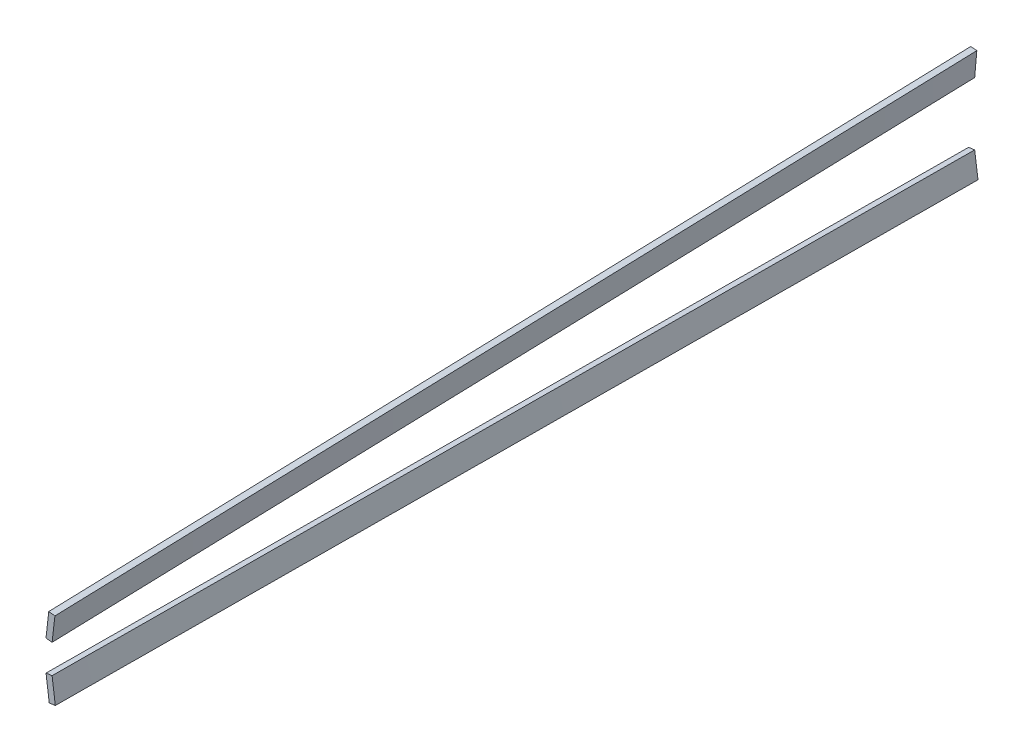
ISO-10303-21;
HEADER;
FILE_DESCRIPTION(('STEP AP214'),'2;1');
FILE_NAME('part.step','',(''),(''),'','','');
FILE_SCHEMA(('AUTOMOTIVE_DESIGN { 1 0 10303 214 1 1 1 1 }'));
ENDSEC;
DATA;
#1=APPLICATION_CONTEXT('core data for automotive mechanical design processes');
#2=APPLICATION_PROTOCOL_DEFINITION('international standard','automotive_design',2000,#1);
#3=PRODUCT_CONTEXT('',#1,'mechanical');
#4=PRODUCT('Part','Part','',(#3));
#5=PRODUCT_RELATED_PRODUCT_CATEGORY('part','',(#4));
#6=PRODUCT_DEFINITION_FORMATION('','',#4);
#7=PRODUCT_DEFINITION_CONTEXT('part definition',#1,'design');
#8=PRODUCT_DEFINITION('design','',#6,#7);
#9=PRODUCT_DEFINITION_SHAPE('','',#8);
#10=(LENGTH_UNIT() NAMED_UNIT(*) SI_UNIT(.MILLI.,.METRE.));
#11=(NAMED_UNIT(*) PLANE_ANGLE_UNIT() SI_UNIT($,.RADIAN.));
#12=(NAMED_UNIT(*) SI_UNIT($,.STERADIAN.) SOLID_ANGLE_UNIT());
#13=UNCERTAINTY_MEASURE_WITH_UNIT(LENGTH_MEASURE(1.E-05),#10,'distance_accuracy_value','');
#14=(GEOMETRIC_REPRESENTATION_CONTEXT(3) GLOBAL_UNCERTAINTY_ASSIGNED_CONTEXT((#13)) GLOBAL_UNIT_ASSIGNED_CONTEXT((#10,
#11,#12)) REPRESENTATION_CONTEXT('',''));
#15=CARTESIAN_POINT('',(0.,0.,0.));
#16=DIRECTION('',(0.,0.,1.));
#17=DIRECTION('',(1.,0.,0.));
#18=AXIS2_PLACEMENT_3D('',#15,#16,#17);
#19=CARTESIAN_POINT('',(0.,0.,478.663));
#20=DIRECTION('',(0.,0.,1.));
#21=DIRECTION('',(-1.,0.,0.));
#22=AXIS2_PLACEMENT_3D('',#19,#20,#21);
#23=PLANE('',#22);
#24=CARTESIAN_POINT('',(293.325645427331,15.0769843062237,478.663));
#25=CARTESIAN_POINT('',(293.850159198654,15.1470033379491,478.663));
#26=CARTESIAN_POINT('',(294.374672969977,15.2170223696745,478.663));
#27=CARTESIAN_POINT('',(295.423700512623,15.3570604331252,478.663));
#28=CARTESIAN_POINT('',(295.948214283946,15.4270794648505,478.663));
#29=CARTESIAN_POINT('',(296.472728055268,15.4970984965758,478.663));
#30=B_SPLINE_CURVE_WITH_KNOTS('',3,(#24,#25,#26,#27,#28,#29),.UNSPECIFIED.,.F.,.F.,(4,2,4),(0.,
0.5,1.),.UNSPECIFIED.);
#31=CARTESIAN_POINT('',(293.325645427331,15.0769843062237,478.663));
#32=VERTEX_POINT('',#31);
#33=CARTESIAN_POINT('',(296.472728055268,15.4970984965758,478.663));
#34=VERTEX_POINT('',#33);
#35=EDGE_CURVE('E169',#32,#34,#30,.T.);
#36=ORIENTED_EDGE('',*,*,#35,.F.);
#37=CARTESIAN_POINT('',(295.006102188739,2.48865379447442,478.663));
#38=CARTESIAN_POINT('',(294.726026061838,4.58670887976591,478.663));
#39=CARTESIAN_POINT('',(294.445949934936,6.68476396505743,478.663));
#40=CARTESIAN_POINT('',(293.885797681134,10.8808741356405,478.663));
#41=CARTESIAN_POINT('',(293.605721554232,12.9789292209321,478.663));
#42=CARTESIAN_POINT('',(293.325645427331,15.0769843062237,478.663));
#43=B_SPLINE_CURVE_WITH_KNOTS('',3,(#37,#38,#39,#40,#41,#42),.UNSPECIFIED.,.F.,.F.,(4,2,4),(0.,
0.5,1.),.UNSPECIFIED.);
#44=CARTESIAN_POINT('',(295.006102188739,2.48865379447443,478.663));
#45=VERTEX_POINT('',#44);
#46=EDGE_CURVE('E13',#45,#32,#43,.T.);
#47=ORIENTED_EDGE('',*,*,#46,.F.);
#48=CARTESIAN_POINT('',(298.149010464063,2.90772029071021,478.663000000001));
#49=CARTESIAN_POINT('',(297.738036460832,2.85299888311781,478.663));
#50=CARTESIAN_POINT('',(297.207454639919,2.78229599082885,478.663000000001));
#51=CARTESIAN_POINT('',(296.159817101399,2.64261733002786,478.663000000001));
#52=CARTESIAN_POINT('',(295.523151527565,2.55767637507806,478.663000000001));
#53=CARTESIAN_POINT('',(295.006102188739,2.48865379447443,478.663));
#54=B_SPLINE_CURVE_WITH_KNOTS('',3,(#48,#49,#50,#51,#52,#53),.UNSPECIFIED.,.F.,.F.,(4,1,1,4),
(0.,0.392277227659318,0.506450563931673,1.),.UNSPECIFIED.);
#55=CARTESIAN_POINT('',(298.149010473727,2.90772029199698,478.663));
#56=VERTEX_POINT('',#55);
#57=EDGE_CURVE('E131',#56,#45,#54,.T.);
#58=ORIENTED_EDGE('',*,*,#57,.F.);
#59=CARTESIAN_POINT('',(296.472728055268,15.4970984965758,478.663));
#60=CARTESIAN_POINT('',(296.752108458345,13.3988687958126,478.663));
#61=CARTESIAN_POINT('',(297.031488861421,11.3006390950495,478.663));
#62=CARTESIAN_POINT('',(297.590249667574,7.10417969352324,478.663));
#63=CARTESIAN_POINT('',(297.86963007065,5.00594999276011,478.663));
#64=CARTESIAN_POINT('',(298.149010473727,2.90772029199698,478.663));
#65=B_SPLINE_CURVE_WITH_KNOTS('',3,(#59,#60,#61,#62,#63,#64),.UNSPECIFIED.,.F.,.F.,(4,2,4),(0.,
0.5,1.),.UNSPECIFIED.);
#66=EDGE_CURVE('E259',#34,#56,#65,.T.);
#67=ORIENTED_EDGE('',*,*,#66,.F.);
#68=EDGE_LOOP('',(#36,#47,#58,#67));
#69=FACE_BOUND('',#68,.T.);
#70=ADVANCED_FACE('F121',(#69),#23,.T.);
#71=CARTESIAN_POINT('',(0.,0.,0.));
#72=DIRECTION('',(0.,0.,-1.));
#73=DIRECTION('',(1.,0.,0.));
#74=AXIS2_PLACEMENT_3D('',#71,#72,#73);
#75=PLANE('',#74);
#76=CARTESIAN_POINT('',(293.326645717445,11.965227293806,0.));
#77=CARTESIAN_POINT('',(293.611672752139,9.86783906859072,0.));
#78=CARTESIAN_POINT('',(293.896699786832,7.77045084337541,0.));
#79=CARTESIAN_POINT('',(294.466753856218,3.57567439294485,0.));
#80=CARTESIAN_POINT('',(294.751780890912,1.47828616772958,0.));
#81=CARTESIAN_POINT('',(295.036807925605,-0.619102057485672,0.));
#82=B_SPLINE_CURVE_WITH_KNOTS('',3,(#76,#77,#78,#79,#80,#81),.UNSPECIFIED.,.F.,.F.,(4,2,4),(0.,
0.5,1.),.UNSPECIFIED.);
#83=CARTESIAN_POINT('',(295.036807925605,-0.619102057485672,0.));
#84=VERTEX_POINT('',#83);
#85=CARTESIAN_POINT('',(293.326645717445,11.965227293806,0.));
#86=VERTEX_POINT('',#85);
#87=EDGE_CURVE('E189',#84,#86,#82,.F.);
#88=ORIENTED_EDGE('',*,*,#87,.T.);
#89=CARTESIAN_POINT('',(296.472728055268,12.392767845846,0.));
#90=CARTESIAN_POINT('',(295.948380998964,12.3215110871727,0.));
#91=CARTESIAN_POINT('',(295.424033942661,12.2502543284993,0.));
#92=CARTESIAN_POINT('',(294.375339830053,12.1077408111527,0.));
#93=CARTESIAN_POINT('',(293.850992773749,12.0364840524794,0.));
#94=CARTESIAN_POINT('',(293.326645717445,11.9652272938061,0.));
#95=B_SPLINE_CURVE_WITH_KNOTS('',3,(#89,#90,#91,#92,#93,#94),.UNSPECIFIED.,.F.,.F.,(4,2,4),(0.,
0.5,1.),.UNSPECIFIED.);
#96=CARTESIAN_POINT('',(296.472728055268,12.392767845846,0.));
#97=VERTEX_POINT('',#96);
#98=EDGE_CURVE('E165',#86,#97,#95,.F.);
#99=ORIENTED_EDGE('',*,*,#98,.T.);
#100=CARTESIAN_POINT('',(298.182924105385,-0.19181053348416,0.));
#101=CARTESIAN_POINT('',(297.897891430366,1.90561919640423,0.));
#102=CARTESIAN_POINT('',(297.612858755346,4.0030489262926,0.));
#103=CARTESIAN_POINT('',(297.042793405307,8.19790838606931,0.));
#104=CARTESIAN_POINT('',(296.757760730288,10.2953381159576,0.));
#105=CARTESIAN_POINT('',(296.472728055268,12.392767845846,0.));
#106=B_SPLINE_CURVE_WITH_KNOTS('',3,(#100,#101,#102,#103,#104,#105),.UNSPECIFIED.,.F.,.F.,(4,2,
4),(0.,0.5,1.),.UNSPECIFIED.);
#107=CARTESIAN_POINT('',(298.182924105385,-0.19181053348416,0.));
#108=VERTEX_POINT('',#107);
#109=EDGE_CURVE('E177',#97,#108,#106,.F.);
#110=ORIENTED_EDGE('',*,*,#109,.T.);
#111=CARTESIAN_POINT('',(295.036807925605,-0.619102057485676,0.));
#112=CARTESIAN_POINT('',(295.554390311453,-0.548764591644108,0.));
#113=CARTESIAN_POINT('',(296.191708765441,-0.46217914367285,0.));
#114=CARTESIAN_POINT('',(297.240415087317,-0.319755450715439,0.));
#115=CARTESIAN_POINT('',(297.77153606111,-0.247647448198452,0.));
#116=CARTESIAN_POINT('',(298.182924105385,-0.191810533484172,0.));
#117=B_SPLINE_CURVE_WITH_KNOTS('',3,(#111,#112,#113,#114,#115,#116),.UNSPECIFIED.,.F.,.F.,(4,1,
1,4),(0.,0.493549436068327,0.607722772340682,1.),.UNSPECIFIED.);
#118=EDGE_CURVE('E184',#84,#108,#117,.T.);
#119=ORIENTED_EDGE('',*,*,#118,.F.);
#120=EDGE_LOOP('',(#88,#99,#110,#119));
#121=FACE_BOUND('',#120,.T.);
#122=ADVANCED_FACE('F188',(#121),#75,.T.);
#123=CARTESIAN_POINT('',(295.036807925605,-0.619102057485672,0.));
#124=CARTESIAN_POINT('',(295.006102188739,2.48865379447442,478.663));
#125=CARTESIAN_POINT('',(294.751780890912,1.47828616772958,0.));
#126=CARTESIAN_POINT('',(294.726026061838,4.58670887976591,478.663));
#127=CARTESIAN_POINT('',(294.466753856218,3.57567439294485,0.));
#128=CARTESIAN_POINT('',(294.445949934936,6.68476396505743,478.663));
#129=CARTESIAN_POINT('',(293.896699786832,7.77045084337541,0.));
#130=CARTESIAN_POINT('',(293.885797681134,10.8808741356405,478.663));
#131=CARTESIAN_POINT('',(293.611672752139,9.86783906859072,0.));
#132=CARTESIAN_POINT('',(293.605721554232,12.9789292209321,478.663));
#133=CARTESIAN_POINT('',(293.326645717445,11.965227293806,0.));
#134=CARTESIAN_POINT('',(293.325645427331,15.0769843062237,478.663));
#135=B_SPLINE_SURFACE_WITH_KNOTS('',3,1,((#123,#124),(#125,#126),(#127,#128),(#129,#130),(#131,
#132),(#133,#134)),.UNSPECIFIED.,.F.,.F.,.F.,(4,2,4),(2,2),(0.,0.5,1.),(0.,1.),.UNSPECIFIED.);
#136=DIRECTION('',(6.4147614595899E-05,-0.00649243903577054,-0.999978921838081));
#137=VECTOR('',#136,1.);
#138=CARTESIAN_POINT('',(295.021455057172,0.934775868494372,239.3315));
#139=LINE('',#138,#137);
#140=EDGE_CURVE('E144',#45,#84,#139,.T.);
#141=DIRECTION('',(-2.08971442928665E-06,0.00650079755426387,0.999978869590149));
#142=VECTOR('',#141,1.);
#143=CARTESIAN_POINT('',(293.326145572388,13.5211058000149,239.3315));
#144=LINE('',#143,#142);
#145=EDGE_CURVE('E138',#86,#32,#144,.T.);
#146=ORIENTED_EDGE('',*,*,#87,.F.);
#147=ORIENTED_EDGE('',*,*,#140,.F.);
#148=ORIENTED_EDGE('',*,*,#46,.T.);
#149=ORIENTED_EDGE('',*,*,#145,.F.);
#150=EDGE_LOOP('',(#146,#147,#148,#149));
#151=FACE_BOUND('',#150,.T.);
#152=ADVANCED_FACE('F209',(#151),#135,.F.);
#153=CARTESIAN_POINT('',(293.326645717445,11.9652272938061,0.));
#154=CARTESIAN_POINT('',(293.325645427331,15.0769843062237,478.663));
#155=CARTESIAN_POINT('',(293.850992773749,12.0364840524794,0.));
#156=CARTESIAN_POINT('',(293.850159198654,15.1470033379491,478.663));
#157=CARTESIAN_POINT('',(294.375339830053,12.1077408111527,0.));
#158=CARTESIAN_POINT('',(294.374672969977,15.2170223696745,478.663));
#159=CARTESIAN_POINT('',(295.424033942661,12.2502543284993,0.));
#160=CARTESIAN_POINT('',(295.423700512623,15.3570604331252,478.663));
#161=CARTESIAN_POINT('',(295.948380998964,12.3215110871727,0.));
#162=CARTESIAN_POINT('',(295.948214283946,15.4270794648505,478.663));
#163=CARTESIAN_POINT('',(296.472728055268,12.392767845846,0.));
#164=CARTESIAN_POINT('',(296.472728055268,15.4970984965758,478.663));
#165=B_SPLINE_SURFACE_WITH_KNOTS('',3,1,((#153,#154),(#155,#156),(#157,#158),(#159,#160),(#161,
#162),(#163,#164)),.UNSPECIFIED.,.F.,.F.,.F.,(4,2,4),(2,2),(0.,0.5,1.),(0.,1.),.UNSPECIFIED.);
#166=DIRECTION('',(0.,0.00648528373337653,0.999978970326325));
#167=VECTOR('',#166,1.);
#168=CARTESIAN_POINT('',(296.472728055268,13.9449331712109,239.3315));
#169=LINE('',#168,#167);
#170=EDGE_CURVE('E161',#97,#34,#169,.T.);
#171=ORIENTED_EDGE('',*,*,#98,.F.);
#172=ORIENTED_EDGE('',*,*,#145,.T.);
#173=ORIENTED_EDGE('',*,*,#35,.T.);
#174=ORIENTED_EDGE('',*,*,#170,.F.);
#175=EDGE_LOOP('',(#171,#172,#173,#174));
#176=FACE_BOUND('',#175,.T.);
#177=ADVANCED_FACE('F163',(#176),#165,.F.);
#178=CARTESIAN_POINT('',(298.182924105385,-0.191810533484172,0.));
#179=CARTESIAN_POINT('',(298.149010464063,2.90772029071021,478.663000000001));
#180=CARTESIAN_POINT('',(297.77153606111,-0.247647448198452,0.));
#181=CARTESIAN_POINT('',(297.738036460832,2.85299888311781,478.663));
#182=CARTESIAN_POINT('',(297.240415087317,-0.319755450715439,0.));
#183=CARTESIAN_POINT('',(297.207454639919,2.78229599082885,478.663000000001));
#184=CARTESIAN_POINT('',(296.191708765441,-0.46217914367285,0.));
#185=CARTESIAN_POINT('',(296.159817101399,2.64261733002786,478.663000000001));
#186=CARTESIAN_POINT('',(295.554390311453,-0.548764591644108,0.));
#187=CARTESIAN_POINT('',(295.523151527565,2.55767637507806,478.663000000001));
#188=CARTESIAN_POINT('',(295.036807925605,-0.619102057485676,0.));
#189=CARTESIAN_POINT('',(295.006102188739,2.48865379447443,478.663));
#190=B_SPLINE_SURFACE_WITH_KNOTS('',3,1,((#178,#179),(#180,#181),(#182,#183),(#184,#185),(#186,
#187),(#188,#189)),.UNSPECIFIED.,.F.,.F.,.F.,(4,1,1,4),(2,2),(0.,0.392277227659318,
0.506450563931673,1.),(0.,1.),.UNSPECIFIED.);
#191=DIRECTION('',(-7.08492626011175E-05,0.00647525678187677,0.999979032795183));
#192=VECTOR('',#191,1.);
#193=CARTESIAN_POINT('',(298.165967289556,1.35795487925641,239.3315));
#194=LINE('',#193,#192);
#195=EDGE_CURVE('E174',#108,#56,#194,.T.);
#196=ORIENTED_EDGE('',*,*,#118,.T.);
#197=ORIENTED_EDGE('',*,*,#195,.T.);
#198=ORIENTED_EDGE('',*,*,#57,.T.);
#199=ORIENTED_EDGE('',*,*,#140,.T.);
#200=EDGE_LOOP('',(#196,#197,#198,#199));
#201=FACE_BOUND('',#200,.T.);
#202=ADVANCED_FACE('F279',(#201),#190,.F.);
#203=CARTESIAN_POINT('',(296.472728055268,12.392767845846,0.));
#204=CARTESIAN_POINT('',(296.472728055268,15.4970984965758,478.663));
#205=CARTESIAN_POINT('',(296.757760730288,10.2953381159576,0.));
#206=CARTESIAN_POINT('',(296.752108458345,13.3988687958126,478.663));
#207=CARTESIAN_POINT('',(297.042793405307,8.19790838606931,0.));
#208=CARTESIAN_POINT('',(297.031488861421,11.3006390950495,478.663));
#209=CARTESIAN_POINT('',(297.612858755346,4.0030489262926,0.));
#210=CARTESIAN_POINT('',(297.590249667574,7.10417969352324,478.663));
#211=CARTESIAN_POINT('',(297.897891430366,1.90561919640423,0.));
#212=CARTESIAN_POINT('',(297.86963007065,5.00594999276011,478.663));
#213=CARTESIAN_POINT('',(298.182924105385,-0.19181053348416,0.));
#214=CARTESIAN_POINT('',(298.149010473727,2.90772029199698,478.663));
#215=B_SPLINE_SURFACE_WITH_KNOTS('',3,1,((#203,#204),(#205,#206),(#207,#208),(#209,#210),(#211,
#212),(#213,#214)),.UNSPECIFIED.,.F.,.F.,.F.,(4,2,4),(2,2),(0.,0.5,1.),(0.,1.),.UNSPECIFIED.);
#216=ORIENTED_EDGE('',*,*,#109,.F.);
#217=ORIENTED_EDGE('',*,*,#170,.T.);
#218=ORIENTED_EDGE('',*,*,#66,.T.);
#219=ORIENTED_EDGE('',*,*,#195,.F.);
#220=EDGE_LOOP('',(#216,#217,#218,#219));
#221=FACE_BOUND('',#220,.T.);
#222=ADVANCED_FACE('F179',(#221),#215,.F.);
#223=CLOSED_SHELL('',(#70,#122,#152,#177,#202,#222));
#224=MANIFOLD_SOLID_BREP('B2',#223);
#225=CARTESIAN_POINT('',(0.,0.,478.663));
#226=DIRECTION('',(0.,0.,1.));
#227=DIRECTION('',(-1.,0.,0.));
#228=AXIS2_PLACEMENT_3D('',#225,#226,#227);
#229=PLANE('',#228);
#230=CARTESIAN_POINT('',(297.937186235905,43.0596993771279,478.663));
#231=CARTESIAN_POINT('',(297.693109872466,40.9580906133828,478.663));
#232=CARTESIAN_POINT('',(297.449033509026,38.8564818496377,478.663));
#233=CARTESIAN_POINT('',(296.960880782147,34.6532643221474,478.663));
#234=CARTESIAN_POINT('',(296.716804418708,32.5516555584023,478.663));
#235=CARTESIAN_POINT('',(296.472728055268,30.4500467946572,478.663));
#236=B_SPLINE_CURVE_WITH_KNOTS('',3,(#230,#231,#232,#233,#234,#235),.UNSPECIFIED.,.F.,.F.,(4,2,
4),(0.,0.5,1.),.UNSPECIFIED.);
#237=CARTESIAN_POINT('',(296.472728055268,30.4500467946571,478.663));
#238=VERTEX_POINT('',#237);
#239=CARTESIAN_POINT('',(297.937186245587,43.0596993760035,478.663));
#240=VERTEX_POINT('',#239);
#241=EDGE_CURVE('E589',#238,#240,#236,.F.);
#242=ORIENTED_EDGE('',*,*,#241,.T.);
#243=CARTESIAN_POINT('',(294.738149184402,43.4254797770516,478.663000000001));
#244=CARTESIAN_POINT('',(295.038111051702,43.3917171076995,478.663000000001));
#245=CARTESIAN_POINT('',(295.662836760236,43.3210848735962,478.663000000001));
#246=CARTESIAN_POINT('',(296.72921132522,43.1994065080046,478.663000000001));
#247=CARTESIAN_POINT('',(297.495566443672,43.1109881587418,478.663000000001));
#248=CARTESIAN_POINT('',(297.937186245587,43.0596993760035,478.663000000001));
#249=B_SPLINE_CURVE_WITH_KNOTS('',3,(#243,#244,#245,#246,#247,#248),.UNSPECIFIED.,.F.,.F.,(4,1,
1,4),(0.,0.281242966737679,0.58577280250499,1.),.UNSPECIFIED.);
#250=CARTESIAN_POINT('',(294.738149184402,43.4254797770516,478.663000000001));
#251=VERTEX_POINT('',#250);
#252=EDGE_CURVE('E119',#251,#240,#249,.T.);
#253=ORIENTED_EDGE('',*,*,#252,.F.);
#254=CARTESIAN_POINT('',(293.317650948557,30.8051713512659,478.663));
#255=CARTESIAN_POINT('',(293.554400652963,32.9085560890735,478.663));
#256=CARTESIAN_POINT('',(293.791150357368,35.011940826881,478.663));
#257=CARTESIAN_POINT('',(294.26464976618,39.218710302496,478.663));
#258=CARTESIAN_POINT('',(294.501399470586,41.3220950403035,478.663));
#259=CARTESIAN_POINT('',(294.738149174991,43.4254797781109,478.663));
#260=B_SPLINE_CURVE_WITH_KNOTS('',3,(#254,#255,#256,#257,#258,#259),.UNSPECIFIED.,.F.,.F.,(4,2,
4),(0.,0.5,1.),.UNSPECIFIED.);
#261=CARTESIAN_POINT('',(293.317650948557,30.8051713512659,478.663));
#262=VERTEX_POINT('',#261);
#263=EDGE_CURVE('E455',#251,#262,#260,.F.);
#264=ORIENTED_EDGE('',*,*,#263,.T.);
#265=CARTESIAN_POINT('',(296.472728055268,30.4500467946571,478.663));
#266=CARTESIAN_POINT('',(295.946881870817,30.5092342207585,478.663));
#267=CARTESIAN_POINT('',(295.421035686365,30.5684216468599,478.663));
#268=CARTESIAN_POINT('',(294.369343317462,30.6867964990628,478.663));
#269=CARTESIAN_POINT('',(293.84349713301,30.7459839251643,478.663));
#270=CARTESIAN_POINT('',(293.317650948557,30.8051713512659,478.663));
#271=B_SPLINE_CURVE_WITH_KNOTS('',3,(#265,#266,#267,#268,#269,#270),.UNSPECIFIED.,.F.,.F.,(4,2,
4),(0.,0.5,1.),.UNSPECIFIED.);
#272=EDGE_CURVE('E496',#262,#238,#271,.F.);
#273=ORIENTED_EDGE('',*,*,#272,.T.);
#274=EDGE_LOOP('',(#242,#253,#264,#273));
#275=FACE_BOUND('',#274,.T.);
#276=ADVANCED_FACE('F445',(#275),#229,.T.);
#277=CARTESIAN_POINT('',(0.,0.,0.));
#278=DIRECTION('',(0.,0.,-1.));
#279=DIRECTION('',(1.,0.,0.));
#280=AXIS2_PLACEMENT_3D('',#277,#278,#279);
#281=PLANE('',#280);
#282=CARTESIAN_POINT('',(296.472728055268,44.8819439389783,0.));
#283=CARTESIAN_POINT('',(296.655247044461,46.9899497404776,0.));
#284=CARTESIAN_POINT('',(296.837766033655,49.0979555419769,0.));
#285=CARTESIAN_POINT('',(297.202804012041,53.3139671449754,0.));
#286=CARTESIAN_POINT('',(297.385323001235,55.4219729464747,0.));
#287=CARTESIAN_POINT('',(297.567841990428,57.5299787479739,0.));
#288=B_SPLINE_CURVE_WITH_KNOTS('',3,(#282,#283,#284,#285,#286,#287),.UNSPECIFIED.,.F.,.F.,(4,2,
4),(0.,0.5,1.),.UNSPECIFIED.);
#289=CARTESIAN_POINT('',(296.472728055268,44.8819439389783,0.));
#290=VERTEX_POINT('',#289);
#291=CARTESIAN_POINT('',(297.567841990426,57.529978747974,0.));
#292=VERTEX_POINT('',#291);
#293=EDGE_CURVE('E514',#290,#292,#288,.T.);
#294=ORIENTED_EDGE('',*,*,#293,.F.);
#295=CARTESIAN_POINT('',(293.309562632434,45.1558225759424,0.));
#296=CARTESIAN_POINT('',(293.836756869573,45.1101761364483,0.));
#297=CARTESIAN_POINT('',(294.363951106712,45.0645296969543,0.));
#298=CARTESIAN_POINT('',(295.418339580991,44.9732368179663,0.));
#299=CARTESIAN_POINT('',(295.945533818129,44.9275903784723,0.));
#300=CARTESIAN_POINT('',(296.472728055268,44.8819439389783,0.));
#301=B_SPLINE_CURVE_WITH_KNOTS('',3,(#295,#296,#297,#298,#299,#300),.UNSPECIFIED.,.F.,.F.,(4,2,
4),(0.,0.5,1.),.UNSPECIFIED.);
#302=CARTESIAN_POINT('',(293.309562632434,45.1558225759424,0.));
#303=VERTEX_POINT('',#302);
#304=EDGE_CURVE('E492',#303,#290,#301,.T.);
#305=ORIENTED_EDGE('',*,*,#304,.F.);
#306=CARTESIAN_POINT('',(294.40507718029,57.8084842672797,0.));
#307=CARTESIAN_POINT('',(294.222491422314,55.6997073187235,0.));
#308=CARTESIAN_POINT('',(294.039905664338,53.5909303701672,0.));
#309=CARTESIAN_POINT('',(293.674734148386,49.3733764730548,0.));
#310=CARTESIAN_POINT('',(293.49214839041,47.2645995244986,0.));
#311=CARTESIAN_POINT('',(293.309562632434,45.1558225759424,0.));
#312=B_SPLINE_CURVE_WITH_KNOTS('',3,(#306,#307,#308,#309,#310,#311),.UNSPECIFIED.,.F.,.F.,(4,2,
4),(0.,0.5,1.),.UNSPECIFIED.);
#313=CARTESIAN_POINT('',(294.40507718029,57.8084842672797,0.));
#314=VERTEX_POINT('',#313);
#315=EDGE_CURVE('E503',#314,#303,#312,.T.);
#316=ORIENTED_EDGE('',*,*,#315,.F.);
#317=CARTESIAN_POINT('',(297.567841990426,57.529978747974,0.));
#318=CARTESIAN_POINT('',(297.131197452719,57.5690716309821,0.));
#319=CARTESIAN_POINT('',(296.373501328028,57.6364462580653,0.));
#320=CARTESIAN_POINT('',(295.319227905143,57.7290768928571,0.));
#321=CARTESIAN_POINT('',(294.701616965249,57.78280874885,0.));
#322=CARTESIAN_POINT('',(294.40507718029,57.8084842672797,0.));
#323=B_SPLINE_CURVE_WITH_KNOTS('',3,(#317,#318,#319,#320,#321,#322),.UNSPECIFIED.,.F.,.F.,(4,1,
1,4),(0.,0.41422719749501,0.718757033262321,1.),.UNSPECIFIED.);
#324=EDGE_CURVE('E509',#292,#314,#323,.T.);
#325=ORIENTED_EDGE('',*,*,#324,.F.);
#326=EDGE_LOOP('',(#294,#305,#316,#325));
#327=FACE_BOUND('',#326,.T.);
#328=ADVANCED_FACE('F513',(#327),#281,.T.);
#329=CARTESIAN_POINT('',(296.472728055268,44.8819439389783,0.));
#330=CARTESIAN_POINT('',(296.472728055268,30.4500467946571,478.663));
#331=CARTESIAN_POINT('',(295.945533818129,44.9275903784723,0.));
#332=CARTESIAN_POINT('',(295.946881870817,30.5092342207585,478.663));
#333=CARTESIAN_POINT('',(295.418339580991,44.9732368179663,0.));
#334=CARTESIAN_POINT('',(295.421035686365,30.5684216468599,478.663));
#335=CARTESIAN_POINT('',(294.363951106712,45.0645296969543,0.));
#336=CARTESIAN_POINT('',(294.369343317462,30.6867964990628,478.663));
#337=CARTESIAN_POINT('',(293.836756869573,45.1101761364483,0.));
#338=CARTESIAN_POINT('',(293.84349713301,30.7459839251643,478.663));
#339=CARTESIAN_POINT('',(293.309562632434,45.1558225759424,0.));
#340=CARTESIAN_POINT('',(293.317650948557,30.8051713512659,478.663));
#341=B_SPLINE_SURFACE_WITH_KNOTS('',3,1,((#329,#330),(#331,#332),(#333,#334),(#335,#336),(#337,
#338),(#339,#340)),.UNSPECIFIED.,.F.,.F.,.F.,(4,2,4),(2,2),(0.,0.5,1.),(0.,1.),.UNSPECIFIED.);
#342=DIRECTION('',(0.,0.0301367391354708,-0.999545785321653));
#343=VECTOR('',#342,1.);
#344=CARTESIAN_POINT('',(296.472728055268,37.6659953668177,239.3315));
#345=LINE('',#344,#343);
#346=EDGE_CURVE('E500',#238,#290,#345,.T.);
#347=DIRECTION('',(1.68901367147207E-05,-0.0299672339015207,0.999550881449771));
#348=VECTOR('',#347,1.);
#349=CARTESIAN_POINT('',(293.313606790495,37.9804969636041,239.3315));
#350=LINE('',#349,#348);
#351=EDGE_CURVE('E488',#303,#262,#350,.T.);
#352=ORIENTED_EDGE('',*,*,#304,.T.);
#353=ORIENTED_EDGE('',*,*,#346,.F.);
#354=ORIENTED_EDGE('',*,*,#272,.F.);
#355=ORIENTED_EDGE('',*,*,#351,.F.);
#356=EDGE_LOOP('',(#352,#353,#354,#355));
#357=FACE_BOUND('',#356,.T.);
#358=ADVANCED_FACE('F490',(#357),#341,.F.);
#359=CARTESIAN_POINT('',(293.309562632434,45.1558225759424,0.));
#360=CARTESIAN_POINT('',(293.317650948557,30.8051713512659,478.663));
#361=CARTESIAN_POINT('',(293.49214839041,47.2645995244986,0.));
#362=CARTESIAN_POINT('',(293.554400652963,32.9085560890735,478.663));
#363=CARTESIAN_POINT('',(293.674734148386,49.3733764730548,0.));
#364=CARTESIAN_POINT('',(293.791150357368,35.011940826881,478.663));
#365=CARTESIAN_POINT('',(294.039905664338,53.5909303701672,0.));
#366=CARTESIAN_POINT('',(294.26464976618,39.218710302496,478.663));
#367=CARTESIAN_POINT('',(294.222491422314,55.6997073187235,0.));
#368=CARTESIAN_POINT('',(294.501399470586,41.3220950403035,478.663));
#369=CARTESIAN_POINT('',(294.40507718029,57.8084842672797,0.));
#370=CARTESIAN_POINT('',(294.738149174991,43.4254797781109,478.663));
#371=B_SPLINE_SURFACE_WITH_KNOTS('',3,1,((#359,#360),(#361,#362),(#363,#364),(#365,#366),(#367,
#368),(#369,#370)),.UNSPECIFIED.,.F.,.F.,.F.,(4,2,4),(2,2),(0.,0.5,1.),(0.,1.),.UNSPECIFIED.);
#372=DIRECTION('',(0.000695524096531632,-0.0300347263110679,0.9995486138561));
#373=VECTOR('',#372,1.);
#374=CARTESIAN_POINT('',(294.571613177641,50.6169820226953,239.3315));
#375=LINE('',#374,#373);
#376=EDGE_CURVE('E468',#314,#251,#375,.T.);
#377=ORIENTED_EDGE('',*,*,#315,.T.);
#378=ORIENTED_EDGE('',*,*,#351,.T.);
#379=ORIENTED_EDGE('',*,*,#263,.F.);
#380=ORIENTED_EDGE('',*,*,#376,.F.);
#381=EDGE_LOOP('',(#377,#378,#379,#380));
#382=FACE_BOUND('',#381,.T.);
#383=ADVANCED_FACE('F505',(#382),#371,.F.);
#384=CARTESIAN_POINT('',(297.567841990428,57.5299787479739,0.));
#385=CARTESIAN_POINT('',(297.937186235905,43.0596993771279,478.663));
#386=CARTESIAN_POINT('',(297.385323001235,55.4219729464747,0.));
#387=CARTESIAN_POINT('',(297.693109872466,40.9580906133828,478.663));
#388=CARTESIAN_POINT('',(297.202804012041,53.3139671449754,0.));
#389=CARTESIAN_POINT('',(297.449033509026,38.8564818496377,478.663));
#390=CARTESIAN_POINT('',(296.837766033655,49.0979555419769,0.));
#391=CARTESIAN_POINT('',(296.960880782147,34.6532643221474,478.663));
#392=CARTESIAN_POINT('',(296.655247044461,46.9899497404776,0.));
#393=CARTESIAN_POINT('',(296.716804418708,32.5516555584023,478.663));
#394=CARTESIAN_POINT('',(296.472728055268,44.8819439389783,0.));
#395=CARTESIAN_POINT('',(296.472728055268,30.4500467946572,478.663));
#396=B_SPLINE_SURFACE_WITH_KNOTS('',3,1,((#384,#385),(#386,#387),(#388,#389),(#390,#391),(#392,
#393),(#394,#395)),.UNSPECIFIED.,.F.,.F.,.F.,(4,2,4),(2,2),(0.,0.5,1.),(0.,1.),.UNSPECIFIED.);
#397=DIRECTION('',(0.000771263897280411,-0.0302168069686756,0.999543070472013));
#398=VECTOR('',#397,1.);
#399=CARTESIAN_POINT('',(297.752514118007,50.2948390619888,239.3315));
#400=LINE('',#399,#398);
#401=EDGE_CURVE('E462',#292,#240,#400,.T.);
#402=ORIENTED_EDGE('',*,*,#293,.T.);
#403=ORIENTED_EDGE('',*,*,#401,.T.);
#404=ORIENTED_EDGE('',*,*,#241,.F.);
#405=ORIENTED_EDGE('',*,*,#346,.T.);
#406=EDGE_LOOP('',(#402,#403,#404,#405));
#407=FACE_BOUND('',#406,.T.);
#408=ADVANCED_FACE('F606',(#407),#396,.F.);
#409=CARTESIAN_POINT('',(294.40507718029,57.8084842672797,0.));
#410=CARTESIAN_POINT('',(294.738149184402,43.4254797770516,478.663000000001));
#411=CARTESIAN_POINT('',(294.701616965249,57.78280874885,0.));
#412=CARTESIAN_POINT('',(295.038111051702,43.3917171076995,478.663000000001));
#413=CARTESIAN_POINT('',(295.319227905143,57.7290768928571,0.));
#414=CARTESIAN_POINT('',(295.662836760236,43.3210848735962,478.663000000001));
#415=CARTESIAN_POINT('',(296.373501328028,57.6364462580653,0.));
#416=CARTESIAN_POINT('',(296.72921132522,43.1994065080046,478.663000000001));
#417=CARTESIAN_POINT('',(297.131197452719,57.5690716309821,0.));
#418=CARTESIAN_POINT('',(297.495566443672,43.1109881587418,478.663000000001));
#419=CARTESIAN_POINT('',(297.567841990426,57.529978747974,0.));
#420=CARTESIAN_POINT('',(297.937186245587,43.0596993760035,478.663000000001));
#421=B_SPLINE_SURFACE_WITH_KNOTS('',3,1,((#409,#410),(#411,#412),(#413,#414),(#415,#416),(#417,
#418),(#419,#420)),.UNSPECIFIED.,.F.,.F.,.F.,(4,1,1,4),(2,2),(0.,0.281242966737679,
0.58577280250499,1.),(0.,1.),.UNSPECIFIED.);
#422=ORIENTED_EDGE('',*,*,#324,.T.);
#423=ORIENTED_EDGE('',*,*,#376,.T.);
#424=ORIENTED_EDGE('',*,*,#252,.T.);
#425=ORIENTED_EDGE('',*,*,#401,.F.);
#426=EDGE_LOOP('',(#422,#423,#424,#425));
#427=FACE_BOUND('',#426,.T.);
#428=ADVANCED_FACE('F616',(#427),#421,.F.);
#429=CLOSED_SHELL('',(#276,#328,#358,#383,#408,#428));
#430=MANIFOLD_SOLID_BREP('B7',#429);
#431=ADVANCED_BREP_SHAPE_REPRESENTATION('',(#18,#224,#430),#14);
#432=SHAPE_DEFINITION_REPRESENTATION(#9,#431);
ENDSEC;
END-ISO-10303-21;
